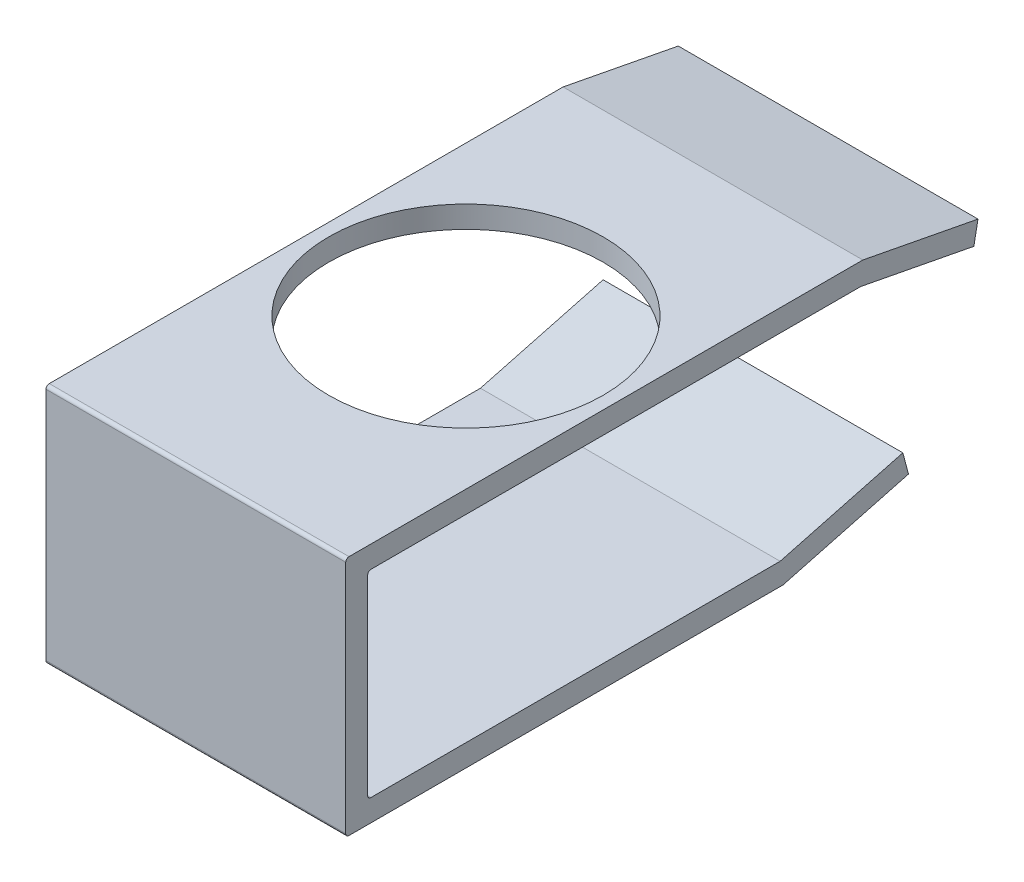
ISO-10303-21;
HEADER;
FILE_DESCRIPTION(('STEP AP214'),'2;1');
FILE_NAME('part.step','',(''),(''),'','','');
FILE_SCHEMA(('AUTOMOTIVE_DESIGN { 1 0 10303 214 1 1 1 1 }'));
ENDSEC;
DATA;
#1=APPLICATION_CONTEXT('core data for automotive mechanical design processes');
#2=APPLICATION_PROTOCOL_DEFINITION('international standard','automotive_design',2000,#1);
#3=PRODUCT_CONTEXT('',#1,'mechanical');
#4=PRODUCT('Part','Part','',(#3));
#5=PRODUCT_RELATED_PRODUCT_CATEGORY('part','',(#4));
#6=PRODUCT_DEFINITION_FORMATION('','',#4);
#7=PRODUCT_DEFINITION_CONTEXT('part definition',#1,'design');
#8=PRODUCT_DEFINITION('design','',#6,#7);
#9=PRODUCT_DEFINITION_SHAPE('','',#8);
#10=(LENGTH_UNIT() NAMED_UNIT(*) SI_UNIT(.MILLI.,.METRE.));
#11=(NAMED_UNIT(*) PLANE_ANGLE_UNIT() SI_UNIT($,.RADIAN.));
#12=(NAMED_UNIT(*) SI_UNIT($,.STERADIAN.) SOLID_ANGLE_UNIT());
#13=UNCERTAINTY_MEASURE_WITH_UNIT(LENGTH_MEASURE(1.E-05),#10,'distance_accuracy_value','');
#14=(GEOMETRIC_REPRESENTATION_CONTEXT(3) GLOBAL_UNCERTAINTY_ASSIGNED_CONTEXT((#13)) GLOBAL_UNIT_ASSIGNED_CONTEXT((#10,
#11,#12)) REPRESENTATION_CONTEXT('',''));
#15=CARTESIAN_POINT('',(0.,0.,0.));
#16=DIRECTION('',(0.,0.,1.));
#17=DIRECTION('',(1.,0.,0.));
#18=AXIS2_PLACEMENT_3D('',#15,#16,#17);
#19=CARTESIAN_POINT('',(2.73,1.89820064469806,-5.65888473936501));
#20=DIRECTION('',(0.,0.188847393650122,0.982006446980648));
#21=DIRECTION('',(0.,-0.982006446980648,0.188847393650122));
#22=AXIS2_PLACEMENT_3D('',#19,#20,#21);
#23=PLANE('',#22);
#24=DIRECTION('',(1.,0.,0.));
#25=VECTOR('',#24,1.);
#26=CARTESIAN_POINT('',(2.73,1.89820064469807,-5.65888473936501));
#27=LINE('',#26,#25);
#28=CARTESIAN_POINT('',(0.,1.89820064469806,-5.65888473936501));
#29=VERTEX_POINT('',#28);
#30=CARTESIAN_POINT('',(2.73,1.89820064469806,-5.65888473936501));
#31=VERTEX_POINT('',#30);
#32=EDGE_CURVE('E220',#29,#31,#27,.T.);
#33=ORIENTED_EDGE('',*,*,#32,.T.);
#34=DIRECTION('',(0.,-0.982006446980648,0.188847393650122));
#35=VECTOR('',#34,1.);
#36=CARTESIAN_POINT('',(2.73,1.89820064469806,-5.65888473936501));
#37=LINE('',#36,#35);
#38=CARTESIAN_POINT('',(2.73,1.70179935530194,-5.62111526063499));
#39=VERTEX_POINT('',#38);
#40=EDGE_CURVE('E247',#39,#31,#37,.F.);
#41=ORIENTED_EDGE('',*,*,#40,.F.);
#42=DIRECTION('',(1.,0.,0.));
#43=VECTOR('',#42,1.);
#44=CARTESIAN_POINT('',(2.73,1.70179935530193,-5.62111526063499));
#45=LINE('',#44,#43);
#46=CARTESIAN_POINT('',(0.,1.70179935530194,-5.62111526063499));
#47=VERTEX_POINT('',#46);
#48=EDGE_CURVE('E226',#39,#47,#45,.F.);
#49=ORIENTED_EDGE('',*,*,#48,.T.);
#50=DIRECTION('',(0.,-0.982006446980648,0.188847393650122));
#51=VECTOR('',#50,1.);
#52=CARTESIAN_POINT('',(0.,1.89820064469806,-5.65888473936501));
#53=LINE('',#52,#51);
#54=EDGE_CURVE('E239',#29,#47,#53,.T.);
#55=ORIENTED_EDGE('',*,*,#54,.F.);
#56=EDGE_LOOP('',(#33,#41,#49,#55));
#57=FACE_BOUND('',#56,.T.);
#58=ADVANCED_FACE('F16',(#57),#23,.F.);
#59=CARTESIAN_POINT('',(2.73,0.1,-3.85695167108941));
#60=DIRECTION('',(0.,-0.96651827859162,-0.256597773077421));
#61=DIRECTION('',(0.,0.256597773077421,-0.96651827859162));
#62=AXIS2_PLACEMENT_3D('',#59,#60,#61);
#63=PLANE('',#62);
#64=DIRECTION('',(1.,0.,0.));
#65=VECTOR('',#64,1.);
#66=CARTESIAN_POINT('',(2.73,0.1,-3.85695167108941));
#67=LINE('',#66,#65);
#68=CARTESIAN_POINT('',(0.,0.1,-3.85695167108941));
#69=VERTEX_POINT('',#68);
#70=CARTESIAN_POINT('',(2.73,0.1,-3.85695167108941));
#71=VERTEX_POINT('',#70);
#72=EDGE_CURVE('E187',#69,#71,#67,.T.);
#73=ORIENTED_EDGE('',*,*,#72,.T.);
#74=DIRECTION('',(0.,0.256597773077421,-0.96651827859162));
#75=VECTOR('',#74,1.);
#76=CARTESIAN_POINT('',(2.73,0.1,-3.85695167108941));
#77=LINE('',#76,#75);
#78=CARTESIAN_POINT('',(2.73,0.396651827859162,-4.97434022269226));
#79=VERTEX_POINT('',#78);
#80=EDGE_CURVE('E235',#79,#71,#77,.F.);
#81=ORIENTED_EDGE('',*,*,#80,.F.);
#82=DIRECTION('',(1.,0.,0.));
#83=VECTOR('',#82,1.);
#84=CARTESIAN_POINT('',(2.73,0.396651827859161,-4.97434022269226));
#85=LINE('',#84,#83);
#86=CARTESIAN_POINT('',(0.,0.396651827859162,-4.97434022269226));
#87=VERTEX_POINT('',#86);
#88=EDGE_CURVE('E200',#79,#87,#85,.F.);
#89=ORIENTED_EDGE('',*,*,#88,.T.);
#90=DIRECTION('',(0.,0.256597773077421,-0.96651827859162));
#91=VECTOR('',#90,1.);
#92=CARTESIAN_POINT('',(0.,0.1,-3.85695167108941));
#93=LINE('',#92,#91);
#94=EDGE_CURVE('E136',#69,#87,#93,.T.);
#95=ORIENTED_EDGE('',*,*,#94,.F.);
#96=EDGE_LOOP('',(#73,#81,#89,#95));
#97=FACE_BOUND('',#96,.T.);
#98=ADVANCED_FACE('F345',(#97),#63,.F.);
#99=CARTESIAN_POINT('',(2.73,0.13,-0.13));
#100=DIRECTION('',(-1.,0.,0.));
#101=DIRECTION('',(0.,0.,1.));
#102=AXIS2_PLACEMENT_3D('',#99,#100,#101);
#103=CYLINDRICAL_SURFACE('',#102,0.03);
#104=DIRECTION('',(1.,0.,0.));
#105=VECTOR('',#104,1.);
#106=CARTESIAN_POINT('',(2.73,0.13,-0.1));
#107=LINE('',#106,#105);
#108=CARTESIAN_POINT('',(0.,0.13,-0.1));
#109=VERTEX_POINT('',#108);
#110=CARTESIAN_POINT('',(2.73,0.13,-0.1));
#111=VERTEX_POINT('',#110);
#112=EDGE_CURVE('E138',#109,#111,#107,.T.);
#113=ORIENTED_EDGE('',*,*,#112,.T.);
#114=CARTESIAN_POINT('',(2.73,0.13,-0.13));
#115=DIRECTION('',(-1.,0.,0.));
#116=DIRECTION('',(0.,0.,1.));
#117=AXIS2_PLACEMENT_3D('',#114,#115,#116);
#118=CIRCLE('',#117,0.03);
#119=CARTESIAN_POINT('',(2.73,0.1,-0.13));
#120=VERTEX_POINT('',#119);
#121=EDGE_CURVE('E19',#120,#111,#118,.T.);
#122=ORIENTED_EDGE('',*,*,#121,.F.);
#123=DIRECTION('',(1.,0.,0.));
#124=VECTOR('',#123,1.);
#125=CARTESIAN_POINT('',(2.73,0.1,-0.13));
#126=LINE('',#125,#124);
#127=CARTESIAN_POINT('',(0.,0.1,-0.13));
#128=VERTEX_POINT('',#127);
#129=EDGE_CURVE('E144',#120,#128,#126,.F.);
#130=ORIENTED_EDGE('',*,*,#129,.T.);
#131=CARTESIAN_POINT('',(0.,0.13,-0.13));
#132=DIRECTION('',(-1.,0.,0.));
#133=DIRECTION('',(0.,0.,1.));
#134=AXIS2_PLACEMENT_3D('',#131,#132,#133);
#135=CIRCLE('',#134,0.03);
#136=EDGE_CURVE('E135',#109,#128,#135,.F.);
#137=ORIENTED_EDGE('',*,*,#136,.F.);
#138=EDGE_LOOP('',(#113,#122,#130,#137));
#139=FACE_BOUND('',#138,.T.);
#140=ADVANCED_FACE('F139',(#139),#103,.F.);
#141=CARTESIAN_POINT('',(2.73,1.87,-0.13));
#142=DIRECTION('',(-1.,0.,0.));
#143=DIRECTION('',(0.,0.,1.));
#144=AXIS2_PLACEMENT_3D('',#141,#142,#143);
#145=CYLINDRICAL_SURFACE('',#144,0.03);
#146=DIRECTION('',(1.,0.,0.));
#147=VECTOR('',#146,1.);
#148=CARTESIAN_POINT('',(2.73,1.9,-0.13));
#149=LINE('',#148,#147);
#150=CARTESIAN_POINT('',(0.,1.9,-0.13));
#151=VERTEX_POINT('',#150);
#152=CARTESIAN_POINT('',(2.73,1.9,-0.13));
#153=VERTEX_POINT('',#152);
#154=EDGE_CURVE('E177',#151,#153,#149,.T.);
#155=ORIENTED_EDGE('',*,*,#154,.T.);
#156=CARTESIAN_POINT('',(2.73,1.87,-0.13));
#157=DIRECTION('',(-1.,0.,0.));
#158=DIRECTION('',(0.,0.,1.));
#159=AXIS2_PLACEMENT_3D('',#156,#157,#158);
#160=CIRCLE('',#159,0.03);
#161=CARTESIAN_POINT('',(2.73,1.87,-0.1));
#162=VERTEX_POINT('',#161);
#163=EDGE_CURVE('E270',#162,#153,#160,.T.);
#164=ORIENTED_EDGE('',*,*,#163,.F.);
#165=DIRECTION('',(1.,0.,0.));
#166=VECTOR('',#165,1.);
#167=CARTESIAN_POINT('',(2.73,1.87,-0.1));
#168=LINE('',#167,#166);
#169=CARTESIAN_POINT('',(0.,1.87,-0.1));
#170=VERTEX_POINT('',#169);
#171=EDGE_CURVE('E143',#162,#170,#168,.F.);
#172=ORIENTED_EDGE('',*,*,#171,.T.);
#173=CARTESIAN_POINT('',(0.,1.87,-0.13));
#174=DIRECTION('',(-1.,0.,0.));
#175=DIRECTION('',(0.,0.,1.));
#176=AXIS2_PLACEMENT_3D('',#173,#174,#175);
#177=CIRCLE('',#176,0.03);
#178=EDGE_CURVE('E227',#151,#170,#177,.F.);
#179=ORIENTED_EDGE('',*,*,#178,.F.);
#180=EDGE_LOOP('',(#155,#164,#172,#179));
#181=FACE_BOUND('',#180,.T.);
#182=ADVANCED_FACE('F352',(#181),#145,.F.);
#183=CARTESIAN_POINT('',(2.73,1.9,-4.59047190820505));
#184=DIRECTION('',(0.,0.982006446980647,-0.188847393650125));
#185=DIRECTION('',(0.,0.188847393650125,0.982006446980647));
#186=AXIS2_PLACEMENT_3D('',#183,#184,#185);
#187=PLANE('',#186);
#188=ORIENTED_EDGE('',*,*,#48,.F.);
#189=DIRECTION('',(0.,0.188847393650125,0.982006446980647));
#190=VECTOR('',#189,1.);
#191=CARTESIAN_POINT('',(2.73,1.9,-4.59047190820505));
#192=LINE('',#191,#190);
#193=CARTESIAN_POINT('',(2.73,1.9,-4.59047190820505));
#194=VERTEX_POINT('',#193);
#195=EDGE_CURVE('E223',#194,#39,#192,.F.);
#196=ORIENTED_EDGE('',*,*,#195,.F.);
#197=DIRECTION('',(1.,0.,0.));
#198=VECTOR('',#197,1.);
#199=CARTESIAN_POINT('',(2.73,1.9,-4.59047190820505));
#200=LINE('',#199,#198);
#201=CARTESIAN_POINT('',(0.,1.9,-4.59047190820505));
#202=VERTEX_POINT('',#201);
#203=EDGE_CURVE('E180',#194,#202,#200,.F.);
#204=ORIENTED_EDGE('',*,*,#203,.T.);
#205=DIRECTION('',(0.,0.188847393650125,0.982006446980647));
#206=VECTOR('',#205,1.);
#207=CARTESIAN_POINT('',(0.,1.9,-4.59047190820505));
#208=LINE('',#207,#206);
#209=EDGE_CURVE('E230',#47,#202,#208,.T.);
#210=ORIENTED_EDGE('',*,*,#209,.F.);
#211=EDGE_LOOP('',(#188,#196,#204,#210));
#212=FACE_BOUND('',#211,.T.);
#213=ADVANCED_FACE('F392',(#212),#187,.F.);
#214=CARTESIAN_POINT('',(2.73,2.1,-4.60952809179495));
#215=DIRECTION('',(0.,-0.982006446980647,0.188847393650124));
#216=DIRECTION('',(0.,-0.188847393650124,-0.982006446980647));
#217=AXIS2_PLACEMENT_3D('',#214,#215,#216);
#218=PLANE('',#217);
#219=DIRECTION('',(1.,0.,0.));
#220=VECTOR('',#219,1.);
#221=CARTESIAN_POINT('',(2.73,2.1,-4.60952809179495));
#222=LINE('',#221,#220);
#223=CARTESIAN_POINT('',(0.,2.1,-4.60952809179495));
#224=VERTEX_POINT('',#223);
#225=CARTESIAN_POINT('',(2.73,2.1,-4.60952809179495));
#226=VERTEX_POINT('',#225);
#227=EDGE_CURVE('E171',#224,#226,#222,.T.);
#228=ORIENTED_EDGE('',*,*,#227,.T.);
#229=DIRECTION('',(0.,-0.188847393650124,-0.982006446980647));
#230=VECTOR('',#229,1.);
#231=CARTESIAN_POINT('',(2.73,2.1,-4.60952809179495));
#232=LINE('',#231,#230);
#233=EDGE_CURVE('E216',#31,#226,#232,.F.);
#234=ORIENTED_EDGE('',*,*,#233,.F.);
#235=ORIENTED_EDGE('',*,*,#32,.F.);
#236=DIRECTION('',(0.,-0.188847393650124,-0.982006446980647));
#237=VECTOR('',#236,1.);
#238=CARTESIAN_POINT('',(0.,2.1,-4.60952809179495));
#239=LINE('',#238,#237);
#240=EDGE_CURVE('E212',#224,#29,#239,.T.);
#241=ORIENTED_EDGE('',*,*,#240,.F.);
#242=EDGE_LOOP('',(#228,#234,#235,#241));
#243=FACE_BOUND('',#242,.T.);
#244=ADVANCED_FACE('F388',(#243),#218,.F.);
#245=CARTESIAN_POINT('',(1.365,1.8,-2.36));
#246=DIRECTION('',(0.,1.,0.));
#247=DIRECTION('',(0.,0.,1.));
#248=AXIS2_PLACEMENT_3D('',#245,#246,#247);
#249=CYLINDRICAL_SURFACE('',#248,1.25);
#250=CARTESIAN_POINT('',(1.365,2.1,-2.36));
#251=DIRECTION('',(0.,1.,0.));
#252=DIRECTION('',(0.,0.,1.));
#253=AXIS2_PLACEMENT_3D('',#250,#251,#252);
#254=CIRCLE('',#253,1.25);
#255=CARTESIAN_POINT('',(1.365,2.1,-1.11));
#256=VERTEX_POINT('',#255);
#257=EDGE_CURVE('E167',#256,#256,#254,.T.);
#258=ORIENTED_EDGE('',*,*,#257,.T.);
#259=EDGE_LOOP('',(#258));
#260=FACE_BOUND('',#259,.T.);
#261=CARTESIAN_POINT('',(1.365,1.9,-2.36));
#262=DIRECTION('',(0.,1.,0.));
#263=DIRECTION('',(0.,0.,1.));
#264=AXIS2_PLACEMENT_3D('',#261,#262,#263);
#265=CIRCLE('',#264,1.25);
#266=CARTESIAN_POINT('',(1.365,1.9,-1.11));
#267=VERTEX_POINT('',#266);
#268=EDGE_CURVE('E174',#267,#267,#265,.F.);
#269=ORIENTED_EDGE('',*,*,#268,.T.);
#270=EDGE_LOOP('',(#269));
#271=FACE_BOUND('',#270,.T.);
#272=ADVANCED_FACE('F385',(#260,#271),#249,.F.);
#273=CARTESIAN_POINT('',(2.73,2.07,0.07));
#274=DIRECTION('',(-1.,0.,0.));
#275=DIRECTION('',(0.,0.,1.));
#276=AXIS2_PLACEMENT_3D('',#273,#274,#275);
#277=CYLINDRICAL_SURFACE('',#276,0.03);
#278=CARTESIAN_POINT('',(2.73,2.07,0.07));
#279=DIRECTION('',(-1.,0.,0.));
#280=DIRECTION('',(0.,0.,1.));
#281=AXIS2_PLACEMENT_3D('',#278,#279,#280);
#282=CIRCLE('',#281,0.03);
#283=CARTESIAN_POINT('',(2.73,2.07,0.1));
#284=VERTEX_POINT('',#283);
#285=CARTESIAN_POINT('',(2.73,2.1,0.0699999999999999));
#286=VERTEX_POINT('',#285);
#287=EDGE_CURVE('E209',#284,#286,#282,.T.);
#288=ORIENTED_EDGE('',*,*,#287,.T.);
#289=DIRECTION('',(1.,0.,0.));
#290=VECTOR('',#289,1.);
#291=CARTESIAN_POINT('',(2.73,2.1,0.0699999999999998));
#292=LINE('',#291,#290);
#293=CARTESIAN_POINT('',(0.,2.1,0.0699999999999999));
#294=VERTEX_POINT('',#293);
#295=EDGE_CURVE('E168',#286,#294,#292,.F.);
#296=ORIENTED_EDGE('',*,*,#295,.T.);
#297=CARTESIAN_POINT('',(0.,2.07,0.07));
#298=DIRECTION('',(-1.,0.,0.));
#299=DIRECTION('',(0.,0.,1.));
#300=AXIS2_PLACEMENT_3D('',#297,#298,#299);
#301=CIRCLE('',#300,0.03);
#302=CARTESIAN_POINT('',(0.,2.07,0.1));
#303=VERTEX_POINT('',#302);
#304=EDGE_CURVE('E215',#294,#303,#301,.F.);
#305=ORIENTED_EDGE('',*,*,#304,.T.);
#306=DIRECTION('',(-1.,0.,0.));
#307=VECTOR('',#306,1.);
#308=CARTESIAN_POINT('',(2.73,2.07,0.1));
#309=LINE('',#308,#307);
#310=EDGE_CURVE('E164',#303,#284,#309,.F.);
#311=ORIENTED_EDGE('',*,*,#310,.T.);
#312=EDGE_LOOP('',(#288,#296,#305,#311));
#313=FACE_BOUND('',#312,.T.);
#314=ADVANCED_FACE('F323',(#313),#277,.T.);
#315=CARTESIAN_POINT('',(2.73,0.203348172140838,-5.02565977730774));
#316=DIRECTION('',(0.,-0.256597773077424,0.966518278591619));
#317=DIRECTION('',(0.,-0.966518278591619,-0.256597773077424));
#318=AXIS2_PLACEMENT_3D('',#315,#316,#317);
#319=PLANE('',#318);
#320=ORIENTED_EDGE('',*,*,#88,.F.);
#321=DIRECTION('',(0.,0.966518278591626,0.2565977730774));
#322=VECTOR('',#321,1.);
#323=CARTESIAN_POINT('',(2.73,0.203348172140838,-5.02565977730774));
#324=LINE('',#323,#322);
#325=CARTESIAN_POINT('',(2.73,0.203348172140837,-5.02565977730774));
#326=VERTEX_POINT('',#325);
#327=EDGE_CURVE('E154',#326,#79,#324,.T.);
#328=ORIENTED_EDGE('',*,*,#327,.F.);
#329=DIRECTION('',(1.,0.,0.));
#330=VECTOR('',#329,1.);
#331=CARTESIAN_POINT('',(2.73,0.203348172140836,-5.02565977730774));
#332=LINE('',#331,#330);
#333=CARTESIAN_POINT('',(0.,0.203348172140837,-5.02565977730774));
#334=VERTEX_POINT('',#333);
#335=EDGE_CURVE('E193',#326,#334,#332,.F.);
#336=ORIENTED_EDGE('',*,*,#335,.T.);
#337=DIRECTION('',(0.,-0.966518278591619,-0.256597773077424));
#338=VECTOR('',#337,1.);
#339=CARTESIAN_POINT('',(0.,0.203348172140838,-5.02565977730774));
#340=LINE('',#339,#338);
#341=EDGE_CURVE('E190',#87,#334,#340,.T.);
#342=ORIENTED_EDGE('',*,*,#341,.F.);
#343=EDGE_LOOP('',(#320,#328,#336,#342));
#344=FACE_BOUND('',#343,.T.);
#345=ADVANCED_FACE('F343',(#344),#319,.F.);
#346=CARTESIAN_POINT('',(2.73,0.1,-0.13));
#347=DIRECTION('',(0.,-1.,0.));
#348=DIRECTION('',(0.,0.,-1.));
#349=AXIS2_PLACEMENT_3D('',#346,#347,#348);
#350=PLANE('',#349);
#351=ORIENTED_EDGE('',*,*,#129,.F.);
#352=DIRECTION('',(0.,0.,-1.));
#353=VECTOR('',#352,1.);
#354=CARTESIAN_POINT('',(2.73,0.1,0.07));
#355=LINE('',#354,#353);
#356=EDGE_CURVE('E134',#71,#120,#355,.F.);
#357=ORIENTED_EDGE('',*,*,#356,.F.);
#358=ORIENTED_EDGE('',*,*,#72,.F.);
#359=DIRECTION('',(0.,0.,-1.));
#360=VECTOR('',#359,1.);
#361=CARTESIAN_POINT('',(0.,0.1,0.07));
#362=LINE('',#361,#360);
#363=EDGE_CURVE('E275',#69,#128,#362,.F.);
#364=ORIENTED_EDGE('',*,*,#363,.T.);
#365=EDGE_LOOP('',(#351,#357,#358,#364));
#366=FACE_BOUND('',#365,.T.);
#367=ADVANCED_FACE('F279',(#366),#350,.F.);
#368=CARTESIAN_POINT('',(2.73,0.13,-0.1));
#369=DIRECTION('',(0.,0.,1.));
#370=DIRECTION('',(1.,0.,0.));
#371=AXIS2_PLACEMENT_3D('',#368,#369,#370);
#372=PLANE('',#371);
#373=ORIENTED_EDGE('',*,*,#171,.F.);
#374=DIRECTION('',(0.,1.,0.));
#375=VECTOR('',#374,1.);
#376=CARTESIAN_POINT('',(2.73,-0.07,-0.1));
#377=LINE('',#376,#375);
#378=EDGE_CURVE('E132',#111,#162,#377,.T.);
#379=ORIENTED_EDGE('',*,*,#378,.F.);
#380=ORIENTED_EDGE('',*,*,#112,.F.);
#381=DIRECTION('',(0.,1.,0.));
#382=VECTOR('',#381,1.);
#383=CARTESIAN_POINT('',(0.,-0.07,-0.1));
#384=LINE('',#383,#382);
#385=EDGE_CURVE('E276',#109,#170,#384,.T.);
#386=ORIENTED_EDGE('',*,*,#385,.T.);
#387=EDGE_LOOP('',(#373,#379,#380,#386));
#388=FACE_BOUND('',#387,.T.);
#389=ADVANCED_FACE('F147',(#388),#372,.F.);
#390=CARTESIAN_POINT('',(2.73,1.9,-0.13));
#391=DIRECTION('',(0.,1.,0.));
#392=DIRECTION('',(0.,0.,1.));
#393=AXIS2_PLACEMENT_3D('',#390,#391,#392);
#394=PLANE('',#393);
#395=ORIENTED_EDGE('',*,*,#268,.F.);
#396=EDGE_LOOP('',(#395));
#397=FACE_BOUND('',#396,.T.);
#398=ORIENTED_EDGE('',*,*,#203,.F.);
#399=DIRECTION('',(0.,0.,-1.));
#400=VECTOR('',#399,1.);
#401=CARTESIAN_POINT('',(2.73,1.9,0.07));
#402=LINE('',#401,#400);
#403=EDGE_CURVE('E149',#153,#194,#402,.T.);
#404=ORIENTED_EDGE('',*,*,#403,.F.);
#405=ORIENTED_EDGE('',*,*,#154,.F.);
#406=DIRECTION('',(0.,0.,-1.));
#407=VECTOR('',#406,1.);
#408=CARTESIAN_POINT('',(0.,1.9,0.07));
#409=LINE('',#408,#407);
#410=EDGE_CURVE('E281',#151,#202,#409,.T.);
#411=ORIENTED_EDGE('',*,*,#410,.T.);
#412=EDGE_LOOP('',(#398,#404,#405,#411));
#413=FACE_BOUND('',#412,.T.);
#414=ADVANCED_FACE('F372',(#397,#413),#394,.F.);
#415=CARTESIAN_POINT('',(2.73,2.1,0.0699999999999998));
#416=DIRECTION('',(0.,-1.,0.));
#417=DIRECTION('',(0.,0.,-1.));
#418=AXIS2_PLACEMENT_3D('',#415,#416,#417);
#419=PLANE('',#418);
#420=ORIENTED_EDGE('',*,*,#257,.F.);
#421=EDGE_LOOP('',(#420));
#422=FACE_BOUND('',#421,.T.);
#423=ORIENTED_EDGE('',*,*,#295,.F.);
#424=DIRECTION('',(0.,0.,-1.));
#425=VECTOR('',#424,1.);
#426=CARTESIAN_POINT('',(2.73,2.1,0.07));
#427=LINE('',#426,#425);
#428=EDGE_CURVE('E152',#226,#286,#427,.F.);
#429=ORIENTED_EDGE('',*,*,#428,.F.);
#430=ORIENTED_EDGE('',*,*,#227,.F.);
#431=DIRECTION('',(0.,0.,-1.));
#432=VECTOR('',#431,1.);
#433=CARTESIAN_POINT('',(0.,2.1,0.07));
#434=LINE('',#433,#432);
#435=EDGE_CURVE('E321',#224,#294,#434,.F.);
#436=ORIENTED_EDGE('',*,*,#435,.T.);
#437=EDGE_LOOP('',(#423,#429,#430,#436));
#438=FACE_BOUND('',#437,.T.);
#439=ADVANCED_FACE('F318',(#422,#438),#419,.F.);
#440=CARTESIAN_POINT('',(2.73,-0.0699999999999998,0.1));
#441=DIRECTION('',(0.,0.,-1.));
#442=DIRECTION('',(-1.,0.,0.));
#443=AXIS2_PLACEMENT_3D('',#440,#441,#442);
#444=PLANE('',#443);
#445=DIRECTION('',(-1.,0.,0.));
#446=VECTOR('',#445,1.);
#447=CARTESIAN_POINT('',(2.73,-0.07,0.1));
#448=LINE('',#447,#446);
#449=CARTESIAN_POINT('',(2.73,-0.07,0.1));
#450=VERTEX_POINT('',#449);
#451=CARTESIAN_POINT('',(0.,-0.07,0.1));
#452=VERTEX_POINT('',#451);
#453=EDGE_CURVE('E161',#450,#452,#448,.T.);
#454=ORIENTED_EDGE('',*,*,#453,.F.);
#455=DIRECTION('',(0.,1.,0.));
#456=VECTOR('',#455,1.);
#457=CARTESIAN_POINT('',(2.73,-0.07,0.1));
#458=LINE('',#457,#456);
#459=EDGE_CURVE('E301',#284,#450,#458,.F.);
#460=ORIENTED_EDGE('',*,*,#459,.F.);
#461=ORIENTED_EDGE('',*,*,#310,.F.);
#462=DIRECTION('',(0.,1.,0.));
#463=VECTOR('',#462,1.);
#464=CARTESIAN_POINT('',(0.,-0.07,0.1));
#465=LINE('',#464,#463);
#466=EDGE_CURVE('E261',#303,#452,#465,.F.);
#467=ORIENTED_EDGE('',*,*,#466,.T.);
#468=EDGE_LOOP('',(#454,#460,#461,#467));
#469=FACE_BOUND('',#468,.T.);
#470=ADVANCED_FACE('F328',(#469),#444,.F.);
#471=CARTESIAN_POINT('',(2.73,-0.07,0.07));
#472=DIRECTION('',(-1.,0.,0.));
#473=DIRECTION('',(0.,0.,1.));
#474=AXIS2_PLACEMENT_3D('',#471,#472,#473);
#475=CYLINDRICAL_SURFACE('',#474,0.03);
#476=CARTESIAN_POINT('',(2.73,-0.07,0.07));
#477=DIRECTION('',(-1.,0.,0.));
#478=DIRECTION('',(0.,0.,1.));
#479=AXIS2_PLACEMENT_3D('',#476,#477,#478);
#480=CIRCLE('',#479,0.03);
#481=CARTESIAN_POINT('',(2.73,-0.1,0.0699999999999999));
#482=VERTEX_POINT('',#481);
#483=EDGE_CURVE('E163',#450,#482,#480,.F.);
#484=ORIENTED_EDGE('',*,*,#483,.F.);
#485=ORIENTED_EDGE('',*,*,#453,.T.);
#486=CARTESIAN_POINT('',(0.,-0.07,0.07));
#487=DIRECTION('',(-1.,0.,0.));
#488=DIRECTION('',(0.,0.,1.));
#489=AXIS2_PLACEMENT_3D('',#486,#487,#488);
#490=CIRCLE('',#489,0.03);
#491=CARTESIAN_POINT('',(0.,-0.1,0.0699999999999999));
#492=VERTEX_POINT('',#491);
#493=EDGE_CURVE('E257',#452,#492,#490,.F.);
#494=ORIENTED_EDGE('',*,*,#493,.T.);
#495=DIRECTION('',(1.,0.,0.));
#496=VECTOR('',#495,1.);
#497=CARTESIAN_POINT('',(2.73,-0.1,0.0699999999999998));
#498=LINE('',#497,#496);
#499=EDGE_CURVE('E260',#492,#482,#498,.T.);
#500=ORIENTED_EDGE('',*,*,#499,.T.);
#501=EDGE_LOOP('',(#484,#485,#494,#500));
#502=FACE_BOUND('',#501,.T.);
#503=ADVANCED_FACE('F332',(#502),#475,.T.);
#504=CARTESIAN_POINT('',(2.73,-0.07,0.07));
#505=DIRECTION('',(1.,0.,0.));
#506=DIRECTION('',(0.,0.,-1.));
#507=AXIS2_PLACEMENT_3D('',#504,#505,#506);
#508=PLANE('',#507);
#509=ORIENTED_EDGE('',*,*,#287,.F.);
#510=ORIENTED_EDGE('',*,*,#459,.T.);
#511=ORIENTED_EDGE('',*,*,#483,.T.);
#512=DIRECTION('',(0.,0.,1.));
#513=VECTOR('',#512,1.);
#514=CARTESIAN_POINT('',(2.73,-0.1,0.0699999999999998));
#515=LINE('',#514,#513);
#516=CARTESIAN_POINT('',(2.73,-0.1,-3.88304832891059));
#517=VERTEX_POINT('',#516);
#518=EDGE_CURVE('E289',#482,#517,#515,.F.);
#519=ORIENTED_EDGE('',*,*,#518,.T.);
#520=DIRECTION('',(0.,-0.256597773077421,0.96651827859162));
#521=VECTOR('',#520,1.);
#522=CARTESIAN_POINT('',(2.73,-0.1,-3.88304832891059));
#523=LINE('',#522,#521);
#524=EDGE_CURVE('E196',#517,#326,#523,.F.);
#525=ORIENTED_EDGE('',*,*,#524,.T.);
#526=ORIENTED_EDGE('',*,*,#327,.T.);
#527=ORIENTED_EDGE('',*,*,#80,.T.);
#528=ORIENTED_EDGE('',*,*,#356,.T.);
#529=ORIENTED_EDGE('',*,*,#121,.T.);
#530=ORIENTED_EDGE('',*,*,#378,.T.);
#531=ORIENTED_EDGE('',*,*,#163,.T.);
#532=ORIENTED_EDGE('',*,*,#403,.T.);
#533=ORIENTED_EDGE('',*,*,#195,.T.);
#534=ORIENTED_EDGE('',*,*,#40,.T.);
#535=ORIENTED_EDGE('',*,*,#233,.T.);
#536=ORIENTED_EDGE('',*,*,#428,.T.);
#537=EDGE_LOOP('',(#509,#510,#511,#519,#525,#526,#527,#528,#529,#530,#531,#532,#533,#534,#535,#536));
#538=FACE_BOUND('',#537,.T.);
#539=ADVANCED_FACE('F130',(#538),#508,.T.);
#540=CARTESIAN_POINT('',(2.73,-0.1,-3.88304832891059));
#541=DIRECTION('',(0.,0.96651827859162,0.256597773077421));
#542=DIRECTION('',(0.,-0.256597773077421,0.96651827859162));
#543=AXIS2_PLACEMENT_3D('',#540,#541,#542);
#544=PLANE('',#543);
#545=ORIENTED_EDGE('',*,*,#335,.F.);
#546=ORIENTED_EDGE('',*,*,#524,.F.);
#547=DIRECTION('',(1.,0.,0.));
#548=VECTOR('',#547,1.);
#549=CARTESIAN_POINT('',(2.73,-0.1,-3.88304832891059));
#550=LINE('',#549,#548);
#551=CARTESIAN_POINT('',(0.,-0.0999999999999992,-3.8830483289106));
#552=VERTEX_POINT('',#551);
#553=EDGE_CURVE('E25',#517,#552,#550,.F.);
#554=ORIENTED_EDGE('',*,*,#553,.T.);
#555=DIRECTION('',(0.,0.256597773077423,-0.966518278591619));
#556=VECTOR('',#555,1.);
#557=CARTESIAN_POINT('',(0.,-0.1,-3.88304832891059));
#558=LINE('',#557,#556);
#559=EDGE_CURVE('E33',#552,#334,#558,.T.);
#560=ORIENTED_EDGE('',*,*,#559,.T.);
#561=EDGE_LOOP('',(#545,#546,#554,#560));
#562=FACE_BOUND('',#561,.T.);
#563=ADVANCED_FACE('F339',(#562),#544,.F.);
#564=CARTESIAN_POINT('',(0.,-0.07,0.07));
#565=DIRECTION('',(1.,0.,0.));
#566=DIRECTION('',(0.,0.,-1.));
#567=AXIS2_PLACEMENT_3D('',#564,#565,#566);
#568=PLANE('',#567);
#569=ORIENTED_EDGE('',*,*,#466,.F.);
#570=ORIENTED_EDGE('',*,*,#304,.F.);
#571=ORIENTED_EDGE('',*,*,#435,.F.);
#572=ORIENTED_EDGE('',*,*,#240,.T.);
#573=ORIENTED_EDGE('',*,*,#54,.T.);
#574=ORIENTED_EDGE('',*,*,#209,.T.);
#575=ORIENTED_EDGE('',*,*,#410,.F.);
#576=ORIENTED_EDGE('',*,*,#178,.T.);
#577=ORIENTED_EDGE('',*,*,#385,.F.);
#578=ORIENTED_EDGE('',*,*,#136,.T.);
#579=ORIENTED_EDGE('',*,*,#363,.F.);
#580=ORIENTED_EDGE('',*,*,#94,.T.);
#581=ORIENTED_EDGE('',*,*,#341,.T.);
#582=ORIENTED_EDGE('',*,*,#559,.F.);
#583=DIRECTION('',(0.,0.,1.));
#584=VECTOR('',#583,1.);
#585=CARTESIAN_POINT('',(0.,-0.1,0.0699999999999998));
#586=LINE('',#585,#584);
#587=EDGE_CURVE('E11',#552,#492,#586,.T.);
#588=ORIENTED_EDGE('',*,*,#587,.T.);
#589=ORIENTED_EDGE('',*,*,#493,.F.);
#590=EDGE_LOOP('',(#569,#570,#571,#572,#573,#574,#575,#576,#577,#578,#579,#580,#581,#582,#588,#589));
#591=FACE_BOUND('',#590,.T.);
#592=ADVANCED_FACE('F273',(#591),#568,.F.);
#593=CARTESIAN_POINT('',(2.73,-0.1,0.0699999999999998));
#594=DIRECTION('',(0.,1.,0.));
#595=DIRECTION('',(0.,0.,1.));
#596=AXIS2_PLACEMENT_3D('',#593,#594,#595);
#597=PLANE('',#596);
#598=ORIENTED_EDGE('',*,*,#553,.F.);
#599=ORIENTED_EDGE('',*,*,#518,.F.);
#600=ORIENTED_EDGE('',*,*,#499,.F.);
#601=ORIENTED_EDGE('',*,*,#587,.F.);
#602=EDGE_LOOP('',(#598,#599,#600,#601));
#603=FACE_BOUND('',#602,.T.);
#604=ADVANCED_FACE('F336',(#603),#597,.F.);
#605=CLOSED_SHELL('',(#58,#98,#140,#182,#213,#244,#272,#314,#345,#367,#389,#414,#439,#470,#503,
#539,#563,#592,#604));
#606=MANIFOLD_SOLID_BREP('B1',#605);
#607=ADVANCED_BREP_SHAPE_REPRESENTATION('',(#18,#606),#14);
#608=SHAPE_DEFINITION_REPRESENTATION(#9,#607);
ENDSEC;
END-ISO-10303-21;
